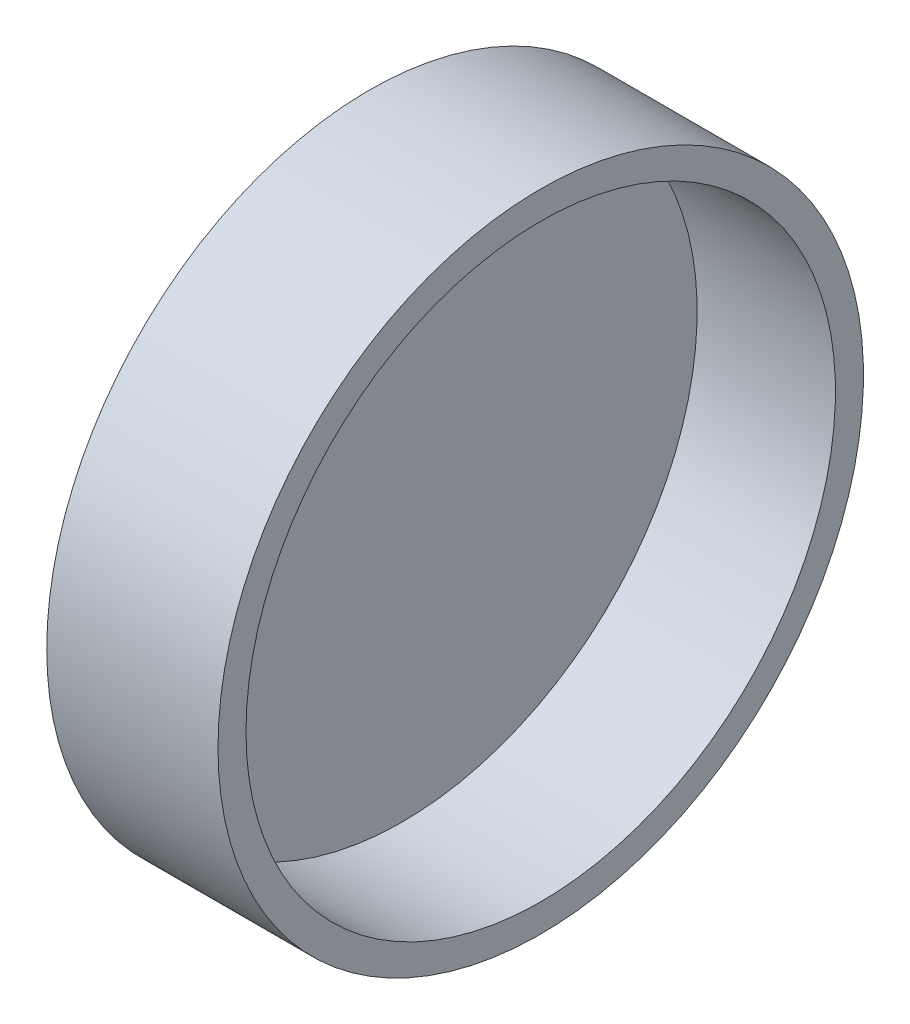
ISO-10303-21;
HEADER;
FILE_DESCRIPTION(('STEP AP214'),'2;1');
FILE_NAME('part.step','',(''),(''),'','','');
FILE_SCHEMA(('AUTOMOTIVE_DESIGN { 1 0 10303 214 1 1 1 1 }'));
ENDSEC;
DATA;
#1=APPLICATION_CONTEXT('core data for automotive mechanical design processes');
#2=APPLICATION_PROTOCOL_DEFINITION('international standard','automotive_design',2000,#1);
#3=PRODUCT_CONTEXT('',#1,'mechanical');
#4=PRODUCT('Part','Part','',(#3));
#5=PRODUCT_RELATED_PRODUCT_CATEGORY('part','',(#4));
#6=PRODUCT_DEFINITION_FORMATION('','',#4);
#7=PRODUCT_DEFINITION_CONTEXT('part definition',#1,'design');
#8=PRODUCT_DEFINITION('design','',#6,#7);
#9=PRODUCT_DEFINITION_SHAPE('','',#8);
#10=(LENGTH_UNIT() NAMED_UNIT(*) SI_UNIT(.MILLI.,.METRE.));
#11=(NAMED_UNIT(*) PLANE_ANGLE_UNIT() SI_UNIT($,.RADIAN.));
#12=(NAMED_UNIT(*) SI_UNIT($,.STERADIAN.) SOLID_ANGLE_UNIT());
#13=UNCERTAINTY_MEASURE_WITH_UNIT(LENGTH_MEASURE(1.E-05),#10,'distance_accuracy_value','');
#14=(GEOMETRIC_REPRESENTATION_CONTEXT(3) GLOBAL_UNCERTAINTY_ASSIGNED_CONTEXT((#13)) GLOBAL_UNIT_ASSIGNED_CONTEXT((#10,
#11,#12)) REPRESENTATION_CONTEXT('',''));
#15=CARTESIAN_POINT('',(0.,0.,0.));
#16=DIRECTION('',(0.,0.,1.));
#17=DIRECTION('',(1.,0.,0.));
#18=AXIS2_PLACEMENT_3D('',#15,#16,#17);
#19=CARTESIAN_POINT('',(-5.2,0.,0.));
#20=DIRECTION('',(1.,0.,0.));
#21=DIRECTION('',(0.,0.,-1.));
#22=AXIS2_PLACEMENT_3D('',#19,#20,#21);
#23=PLANE('',#22);
#24=CARTESIAN_POINT('',(-5.2,0.,0.));
#25=DIRECTION('',(-1.,0.,0.));
#26=DIRECTION('',(0.,0.,1.));
#27=AXIS2_PLACEMENT_3D('',#24,#25,#26);
#28=CIRCLE('',#27,9.8);
#29=CARTESIAN_POINT('',(-5.2,0.,9.8));
#30=VERTEX_POINT('',#29);
#31=EDGE_CURVE('E10',#30,#30,#28,.T.);
#32=ORIENTED_EDGE('',*,*,#31,.T.);
#33=EDGE_LOOP('',(#32));
#34=FACE_BOUND('',#33,.T.);
#35=ADVANCED_FACE('F15',(#34),#23,.F.);
#36=CARTESIAN_POINT('',(-9.86000352204056,0.,0.));
#37=DIRECTION('',(-1.,0.,0.));
#38=DIRECTION('',(0.,0.,1.));
#39=AXIS2_PLACEMENT_3D('',#36,#37,#38);
#40=CYLINDRICAL_SURFACE('',#39,9.8);
#41=ORIENTED_EDGE('',*,*,#31,.F.);
#42=EDGE_LOOP('',(#41));
#43=FACE_BOUND('',#42,.T.);
#44=CARTESIAN_POINT('',(0.,0.,0.));
#45=DIRECTION('',(-1.,0.,0.));
#46=DIRECTION('',(0.,0.,1.));
#47=AXIS2_PLACEMENT_3D('',#44,#45,#46);
#48=CIRCLE('',#47,9.8);
#49=CARTESIAN_POINT('',(0.,0.,9.8));
#50=VERTEX_POINT('',#49);
#51=EDGE_CURVE('E21',#50,#50,#48,.T.);
#52=ORIENTED_EDGE('',*,*,#51,.T.);
#53=EDGE_LOOP('',(#52));
#54=FACE_BOUND('',#53,.T.);
#55=ADVANCED_FACE('F48',(#43,#54),#40,.T.);
#56=CARTESIAN_POINT('',(0.,9.8,0.));
#57=DIRECTION('',(-1.,0.,0.));
#58=DIRECTION('',(0.,0.,1.));
#59=AXIS2_PLACEMENT_3D('',#56,#57,#58);
#60=PLANE('',#59);
#61=ORIENTED_EDGE('',*,*,#51,.F.);
#62=EDGE_LOOP('',(#61));
#63=FACE_BOUND('',#62,.T.);
#64=CARTESIAN_POINT('',(0.,0.,0.));
#65=DIRECTION('',(-1.,0.,0.));
#66=DIRECTION('',(0.,0.,1.));
#67=AXIS2_PLACEMENT_3D('',#64,#65,#66);
#68=CIRCLE('',#67,8.95);
#69=CARTESIAN_POINT('',(0.,0.,8.95));
#70=VERTEX_POINT('',#69);
#71=EDGE_CURVE('E25',#70,#70,#68,.T.);
#72=ORIENTED_EDGE('',*,*,#71,.T.);
#73=EDGE_LOOP('',(#72));
#74=FACE_BOUND('',#73,.T.);
#75=ADVANCED_FACE('F44',(#63,#74),#60,.F.);
#76=CARTESIAN_POINT('',(-9.86000352204056,0.,0.));
#77=DIRECTION('',(-1.,0.,0.));
#78=DIRECTION('',(0.,0.,1.));
#79=AXIS2_PLACEMENT_3D('',#76,#77,#78);
#80=CYLINDRICAL_SURFACE('',#79,8.95);
#81=ORIENTED_EDGE('',*,*,#71,.F.);
#82=EDGE_LOOP('',(#81));
#83=FACE_BOUND('',#82,.T.);
#84=CARTESIAN_POINT('',(-4.2,0.,0.));
#85=DIRECTION('',(-1.,0.,0.));
#86=DIRECTION('',(0.,0.,1.));
#87=AXIS2_PLACEMENT_3D('',#84,#85,#86);
#88=CIRCLE('',#87,8.95);
#89=CARTESIAN_POINT('',(-4.2,0.,8.95));
#90=VERTEX_POINT('',#89);
#91=EDGE_CURVE('E29',#90,#90,#88,.T.);
#92=ORIENTED_EDGE('',*,*,#91,.T.);
#93=EDGE_LOOP('',(#92));
#94=FACE_BOUND('',#93,.T.);
#95=ADVANCED_FACE('F35',(#83,#94),#80,.F.);
#96=CARTESIAN_POINT('',(-4.2,8.95,0.));
#97=DIRECTION('',(-1.,0.,0.));
#98=DIRECTION('',(0.,0.,1.));
#99=AXIS2_PLACEMENT_3D('',#96,#97,#98);
#100=PLANE('',#99);
#101=ORIENTED_EDGE('',*,*,#91,.F.);
#102=EDGE_LOOP('',(#101));
#103=FACE_BOUND('',#102,.T.);
#104=ADVANCED_FACE('F37',(#103),#100,.F.);
#105=CLOSED_SHELL('',(#35,#55,#75,#95,#104));
#106=MANIFOLD_SOLID_BREP('B1',#105);
#107=ADVANCED_BREP_SHAPE_REPRESENTATION('',(#18,#106),#14);
#108=SHAPE_DEFINITION_REPRESENTATION(#9,#107);
ENDSEC;
END-ISO-10303-21;
